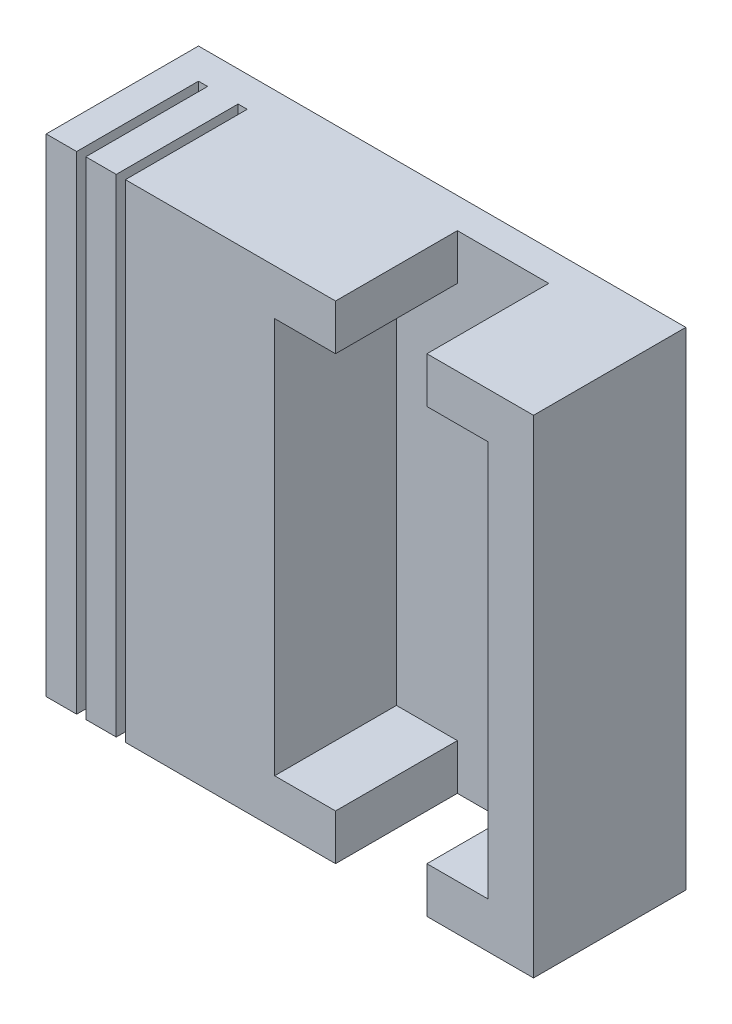
ISO-10303-21;
HEADER;
FILE_DESCRIPTION(('STEP AP214'),'2;1');
FILE_NAME('part.step','',(''),(''),'','','');
FILE_SCHEMA(('AUTOMOTIVE_DESIGN { 1 0 10303 214 1 1 1 1 }'));
ENDSEC;
DATA;
#1=APPLICATION_CONTEXT('core data for automotive mechanical design processes');
#2=APPLICATION_PROTOCOL_DEFINITION('international standard','automotive_design',2000,#1);
#3=PRODUCT_CONTEXT('',#1,'mechanical');
#4=PRODUCT('Part','Part','',(#3));
#5=PRODUCT_RELATED_PRODUCT_CATEGORY('part','',(#4));
#6=PRODUCT_DEFINITION_FORMATION('','',#4);
#7=PRODUCT_DEFINITION_CONTEXT('part definition',#1,'design');
#8=PRODUCT_DEFINITION('design','',#6,#7);
#9=PRODUCT_DEFINITION_SHAPE('','',#8);
#10=(LENGTH_UNIT() NAMED_UNIT(*) SI_UNIT(.MILLI.,.METRE.));
#11=(NAMED_UNIT(*) PLANE_ANGLE_UNIT() SI_UNIT($,.RADIAN.));
#12=(NAMED_UNIT(*) SI_UNIT($,.STERADIAN.) SOLID_ANGLE_UNIT());
#13=UNCERTAINTY_MEASURE_WITH_UNIT(LENGTH_MEASURE(1.E-05),#10,'distance_accuracy_value','');
#14=(GEOMETRIC_REPRESENTATION_CONTEXT(3) GLOBAL_UNCERTAINTY_ASSIGNED_CONTEXT((#13)) GLOBAL_UNIT_ASSIGNED_CONTEXT((#10,
#11,#12)) REPRESENTATION_CONTEXT('',''));
#15=CARTESIAN_POINT('',(0.,0.,0.));
#16=DIRECTION('',(0.,0.,1.));
#17=DIRECTION('',(1.,0.,0.));
#18=AXIS2_PLACEMENT_3D('',#15,#16,#17);
#19=CARTESIAN_POINT('',(0.,0.,6.35));
#20=DIRECTION('',(0.,0.,-1.));
#21=DIRECTION('',(-1.,0.,0.));
#22=AXIS2_PLACEMENT_3D('',#19,#20,#21);
#23=PLANE('',#22);
#24=DIRECTION('',(1.,0.,0.));
#25=VECTOR('',#24,1.);
#26=CARTESIAN_POINT('',(0.,0.,6.35));
#27=LINE('',#26,#25);
#28=CARTESIAN_POINT('',(-20.32,0.,6.35));
#29=VERTEX_POINT('',#28);
#30=CARTESIAN_POINT('',(-19.05,0.,6.35));
#31=VERTEX_POINT('',#30);
#32=EDGE_CURVE('E453',#29,#31,#27,.T.);
#33=ORIENTED_EDGE('',*,*,#32,.T.);
#34=DIRECTION('',(0.,1.,0.));
#35=VECTOR('',#34,1.);
#36=CARTESIAN_POINT('',(-19.05,0.,6.35));
#37=LINE('',#36,#35);
#38=CARTESIAN_POINT('',(-19.05,20.32,6.35));
#39=VERTEX_POINT('',#38);
#40=EDGE_CURVE('E289',#31,#39,#37,.T.);
#41=ORIENTED_EDGE('',*,*,#40,.T.);
#42=DIRECTION('',(-1.,0.,0.));
#43=VECTOR('',#42,1.);
#44=CARTESIAN_POINT('',(0.,20.32,6.35));
#45=LINE('',#44,#43);
#46=CARTESIAN_POINT('',(-20.32,20.32,6.35));
#47=VERTEX_POINT('',#46);
#48=EDGE_CURVE('E241',#39,#47,#45,.T.);
#49=ORIENTED_EDGE('',*,*,#48,.T.);
#50=DIRECTION('',(0.,-1.,0.));
#51=VECTOR('',#50,1.);
#52=CARTESIAN_POINT('',(-20.32,0.,6.35));
#53=LINE('',#52,#51);
#54=EDGE_CURVE('E240',#47,#29,#53,.T.);
#55=ORIENTED_EDGE('',*,*,#54,.T.);
#56=EDGE_LOOP('',(#33,#41,#49,#55));
#57=FACE_BOUND('',#56,.T.);
#58=ADVANCED_FACE('F45',(#57),#23,.F.);
#59=CARTESIAN_POINT('',(-17.399,20.32,6.35));
#60=VERTEX_POINT('',#59);
#61=CARTESIAN_POINT('',(-18.669,20.32,6.35));
#62=VERTEX_POINT('',#61);
#63=EDGE_CURVE('E235',#60,#62,#45,.T.);
#64=ORIENTED_EDGE('',*,*,#63,.T.);
#65=DIRECTION('',(0.,-1.,0.));
#66=VECTOR('',#65,1.);
#67=CARTESIAN_POINT('',(-18.669,0.,6.35));
#68=LINE('',#67,#66);
#69=CARTESIAN_POINT('',(-18.669,0.,6.35));
#70=VERTEX_POINT('',#69);
#71=EDGE_CURVE('E286',#62,#70,#68,.T.);
#72=ORIENTED_EDGE('',*,*,#71,.T.);
#73=CARTESIAN_POINT('',(-17.399,0.,6.35));
#74=VERTEX_POINT('',#73);
#75=EDGE_CURVE('E456',#70,#74,#27,.T.);
#76=ORIENTED_EDGE('',*,*,#75,.T.);
#77=DIRECTION('',(0.,1.,0.));
#78=VECTOR('',#77,1.);
#79=CARTESIAN_POINT('',(-17.399,0.,6.35));
#80=LINE('',#79,#78);
#81=EDGE_CURVE('E214',#74,#60,#80,.T.);
#82=ORIENTED_EDGE('',*,*,#81,.T.);
#83=EDGE_LOOP('',(#64,#72,#76,#82));
#84=FACE_BOUND('',#83,.T.);
#85=ADVANCED_FACE('F529',(#84),#23,.F.);
#86=CARTESIAN_POINT('',(0.,20.32,6.35));
#87=VERTEX_POINT('',#86);
#88=CARTESIAN_POINT('',(-4.445,20.32,6.35));
#89=VERTEX_POINT('',#88);
#90=EDGE_CURVE('E234',#87,#89,#45,.T.);
#91=ORIENTED_EDGE('',*,*,#90,.T.);
#92=DIRECTION('',(0.,1.,0.));
#93=VECTOR('',#92,1.);
#94=CARTESIAN_POINT('',(-4.445,18.415,6.35));
#95=LINE('',#94,#93);
#96=CARTESIAN_POINT('',(-4.445,18.415,6.35));
#97=VERTEX_POINT('',#96);
#98=EDGE_CURVE('E404',#97,#89,#95,.T.);
#99=ORIENTED_EDGE('',*,*,#98,.F.);
#100=DIRECTION('',(-1.,0.,0.));
#101=VECTOR('',#100,1.);
#102=CARTESIAN_POINT('',(-4.445,18.415,6.35));
#103=LINE('',#102,#101);
#104=CARTESIAN_POINT('',(-1.905,18.415,6.35));
#105=VERTEX_POINT('',#104);
#106=EDGE_CURVE('E400',#105,#97,#103,.T.);
#107=ORIENTED_EDGE('',*,*,#106,.F.);
#108=DIRECTION('',(0.,1.,0.));
#109=VECTOR('',#108,1.);
#110=CARTESIAN_POINT('',(-1.905,18.415,6.35));
#111=LINE('',#110,#109);
#112=CARTESIAN_POINT('',(-1.905,1.905,6.35));
#113=VERTEX_POINT('',#112);
#114=EDGE_CURVE('E396',#113,#105,#111,.T.);
#115=ORIENTED_EDGE('',*,*,#114,.F.);
#116=DIRECTION('',(1.,0.,0.));
#117=VECTOR('',#116,1.);
#118=CARTESIAN_POINT('',(-4.445,1.905,6.35));
#119=LINE('',#118,#117);
#120=CARTESIAN_POINT('',(-4.445,1.905,6.35));
#121=VERTEX_POINT('',#120);
#122=EDGE_CURVE('E392',#121,#113,#119,.T.);
#123=ORIENTED_EDGE('',*,*,#122,.F.);
#124=DIRECTION('',(0.,-1.,0.));
#125=VECTOR('',#124,1.);
#126=CARTESIAN_POINT('',(-4.445,0.,6.35));
#127=LINE('',#126,#125);
#128=CARTESIAN_POINT('',(-4.445,0.,6.35));
#129=VERTEX_POINT('',#128);
#130=EDGE_CURVE('E215',#121,#129,#127,.T.);
#131=ORIENTED_EDGE('',*,*,#130,.T.);
#132=CARTESIAN_POINT('',(0.,0.,6.35));
#133=VERTEX_POINT('',#132);
#134=EDGE_CURVE('E264',#129,#133,#27,.T.);
#135=ORIENTED_EDGE('',*,*,#134,.T.);
#136=DIRECTION('',(0.,1.,0.));
#137=VECTOR('',#136,1.);
#138=CARTESIAN_POINT('',(0.,0.,6.35));
#139=LINE('',#138,#137);
#140=EDGE_CURVE('E245',#133,#87,#139,.T.);
#141=ORIENTED_EDGE('',*,*,#140,.T.);
#142=EDGE_LOOP('',(#91,#99,#107,#115,#123,#131,#135,#141));
#143=FACE_BOUND('',#142,.T.);
#144=ADVANCED_FACE('F468',(#143),#23,.F.);
#145=CARTESIAN_POINT('',(0.,0.,6.35));
#146=DIRECTION('',(0.,1.,0.));
#147=DIRECTION('',(0.,0.,1.));
#148=AXIS2_PLACEMENT_3D('',#145,#146,#147);
#149=PLANE('',#148);
#150=DIRECTION('',(1.,0.,0.));
#151=VECTOR('',#150,1.);
#152=CARTESIAN_POINT('',(0.,0.,1.27));
#153=LINE('',#152,#151);
#154=CARTESIAN_POINT('',(-19.05,0.,1.27));
#155=VERTEX_POINT('',#154);
#156=CARTESIAN_POINT('',(-18.669,0.,1.27));
#157=VERTEX_POINT('',#156);
#158=EDGE_CURVE('E333',#155,#157,#153,.T.);
#159=ORIENTED_EDGE('',*,*,#158,.F.);
#160=DIRECTION('',(0.,0.,1.));
#161=VECTOR('',#160,1.);
#162=CARTESIAN_POINT('',(-19.05,0.,6.35));
#163=LINE('',#162,#161);
#164=EDGE_CURVE('E326',#155,#31,#163,.T.);
#165=ORIENTED_EDGE('',*,*,#164,.T.);
#166=ORIENTED_EDGE('',*,*,#32,.F.);
#167=DIRECTION('',(0.,0.,-1.));
#168=VECTOR('',#167,1.);
#169=CARTESIAN_POINT('',(-20.32,0.,6.35));
#170=LINE('',#169,#168);
#171=CARTESIAN_POINT('',(-20.32,0.,0.));
#172=VERTEX_POINT('',#171);
#173=EDGE_CURVE('E249',#29,#172,#170,.T.);
#174=ORIENTED_EDGE('',*,*,#173,.T.);
#175=DIRECTION('',(1.,0.,0.));
#176=VECTOR('',#175,1.);
#177=CARTESIAN_POINT('',(0.,0.,0.));
#178=LINE('',#177,#176);
#179=CARTESIAN_POINT('',(0.,0.,0.));
#180=VERTEX_POINT('',#179);
#181=EDGE_CURVE('E250',#172,#180,#178,.T.);
#182=ORIENTED_EDGE('',*,*,#181,.T.);
#183=DIRECTION('',(0.,0.,-1.));
#184=VECTOR('',#183,1.);
#185=CARTESIAN_POINT('',(0.,0.,6.35));
#186=LINE('',#185,#184);
#187=EDGE_CURVE('E276',#133,#180,#186,.T.);
#188=ORIENTED_EDGE('',*,*,#187,.F.);
#189=ORIENTED_EDGE('',*,*,#134,.F.);
#190=DIRECTION('',(0.,0.,-1.));
#191=VECTOR('',#190,1.);
#192=CARTESIAN_POINT('',(-4.445,0.,6.35));
#193=LINE('',#192,#191);
#194=CARTESIAN_POINT('',(-4.445,0.,1.27));
#195=VERTEX_POINT('',#194);
#196=EDGE_CURVE('E448',#129,#195,#193,.T.);
#197=ORIENTED_EDGE('',*,*,#196,.T.);
#198=DIRECTION('',(1.,0.,0.));
#199=VECTOR('',#198,1.);
#200=CARTESIAN_POINT('',(0.,0.,1.27));
#201=LINE('',#200,#199);
#202=CARTESIAN_POINT('',(-8.255,0.,1.27));
#203=VERTEX_POINT('',#202);
#204=EDGE_CURVE('E255',#203,#195,#201,.T.);
#205=ORIENTED_EDGE('',*,*,#204,.F.);
#206=DIRECTION('',(0.,0.,1.));
#207=VECTOR('',#206,1.);
#208=CARTESIAN_POINT('',(-8.255,0.,6.35));
#209=LINE('',#208,#207);
#210=CARTESIAN_POINT('',(-8.255,0.,6.35));
#211=VERTEX_POINT('',#210);
#212=EDGE_CURVE('E415',#203,#211,#209,.T.);
#213=ORIENTED_EDGE('',*,*,#212,.T.);
#214=CARTESIAN_POINT('',(-17.018,0.,6.35));
#215=VERTEX_POINT('',#214);
#216=EDGE_CURVE('E457',#215,#211,#27,.T.);
#217=ORIENTED_EDGE('',*,*,#216,.F.);
#218=DIRECTION('',(0.,0.,-1.));
#219=VECTOR('',#218,1.);
#220=CARTESIAN_POINT('',(-17.018,0.,6.35));
#221=LINE('',#220,#219);
#222=CARTESIAN_POINT('',(-17.018,0.,1.27));
#223=VERTEX_POINT('',#222);
#224=EDGE_CURVE('E61',#215,#223,#221,.T.);
#225=ORIENTED_EDGE('',*,*,#224,.T.);
#226=DIRECTION('',(1.,0.,0.));
#227=VECTOR('',#226,1.);
#228=CARTESIAN_POINT('',(0.,0.,1.27));
#229=LINE('',#228,#227);
#230=CARTESIAN_POINT('',(-17.399,0.,1.27));
#231=VERTEX_POINT('',#230);
#232=EDGE_CURVE('E330',#231,#223,#229,.T.);
#233=ORIENTED_EDGE('',*,*,#232,.F.);
#234=DIRECTION('',(0.,0.,1.));
#235=VECTOR('',#234,1.);
#236=CARTESIAN_POINT('',(-17.399,0.,6.35));
#237=LINE('',#236,#235);
#238=EDGE_CURVE('E304',#231,#74,#237,.T.);
#239=ORIENTED_EDGE('',*,*,#238,.T.);
#240=ORIENTED_EDGE('',*,*,#75,.F.);
#241=DIRECTION('',(0.,0.,-1.));
#242=VECTOR('',#241,1.);
#243=CARTESIAN_POINT('',(-18.669,0.,6.35));
#244=LINE('',#243,#242);
#245=EDGE_CURVE('E69',#70,#157,#244,.T.);
#246=ORIENTED_EDGE('',*,*,#245,.T.);
#247=EDGE_LOOP('',(#159,#165,#166,#174,#182,#188,#189,#197,#205,#213,#217,#225,#233,#239,#240,#246));
#248=FACE_BOUND('',#247,.T.);
#249=ADVANCED_FACE('F47',(#248),#149,.F.);
#250=CARTESIAN_POINT('',(0.,0.,6.35));
#251=DIRECTION('',(-1.,0.,0.));
#252=DIRECTION('',(0.,0.,1.));
#253=AXIS2_PLACEMENT_3D('',#250,#251,#252);
#254=PLANE('',#253);
#255=DIRECTION('',(0.,1.,0.));
#256=VECTOR('',#255,1.);
#257=CARTESIAN_POINT('',(0.,0.,0.));
#258=LINE('',#257,#256);
#259=CARTESIAN_POINT('',(0.,20.32,0.));
#260=VERTEX_POINT('',#259);
#261=EDGE_CURVE('E254',#180,#260,#258,.T.);
#262=ORIENTED_EDGE('',*,*,#261,.T.);
#263=DIRECTION('',(0.,0.,-1.));
#264=VECTOR('',#263,1.);
#265=CARTESIAN_POINT('',(0.,20.32,6.35));
#266=LINE('',#265,#264);
#267=EDGE_CURVE('E272',#87,#260,#266,.T.);
#268=ORIENTED_EDGE('',*,*,#267,.F.);
#269=ORIENTED_EDGE('',*,*,#140,.F.);
#270=ORIENTED_EDGE('',*,*,#187,.T.);
#271=EDGE_LOOP('',(#262,#268,#269,#270));
#272=FACE_BOUND('',#271,.T.);
#273=ADVANCED_FACE('F474',(#272),#254,.F.);
#274=CARTESIAN_POINT('',(0.,20.32,6.35));
#275=DIRECTION('',(0.,-1.,0.));
#276=DIRECTION('',(0.,0.,-1.));
#277=AXIS2_PLACEMENT_3D('',#274,#275,#276);
#278=PLANE('',#277);
#279=ORIENTED_EDGE('',*,*,#48,.F.);
#280=DIRECTION('',(0.,0.,-1.));
#281=VECTOR('',#280,1.);
#282=CARTESIAN_POINT('',(-19.05,20.32,6.35));
#283=LINE('',#282,#281);
#284=CARTESIAN_POINT('',(-19.05,20.32,1.27));
#285=VERTEX_POINT('',#284);
#286=EDGE_CURVE('E322',#39,#285,#283,.T.);
#287=ORIENTED_EDGE('',*,*,#286,.T.);
#288=DIRECTION('',(-1.,0.,0.));
#289=VECTOR('',#288,1.);
#290=CARTESIAN_POINT('',(0.,20.32,1.27));
#291=LINE('',#290,#289);
#292=CARTESIAN_POINT('',(-18.669,20.32,1.27));
#293=VERTEX_POINT('',#292);
#294=EDGE_CURVE('E11',#293,#285,#291,.T.);
#295=ORIENTED_EDGE('',*,*,#294,.F.);
#296=DIRECTION('',(0.,0.,1.));
#297=VECTOR('',#296,1.);
#298=CARTESIAN_POINT('',(-18.669,20.32,6.35));
#299=LINE('',#298,#297);
#300=EDGE_CURVE('E314',#293,#62,#299,.T.);
#301=ORIENTED_EDGE('',*,*,#300,.T.);
#302=ORIENTED_EDGE('',*,*,#63,.F.);
#303=DIRECTION('',(0.,0.,-1.));
#304=VECTOR('',#303,1.);
#305=CARTESIAN_POINT('',(-17.399,20.32,6.35));
#306=LINE('',#305,#304);
#307=CARTESIAN_POINT('',(-17.399,20.32,1.27));
#308=VERTEX_POINT('',#307);
#309=EDGE_CURVE('E302',#60,#308,#306,.T.);
#310=ORIENTED_EDGE('',*,*,#309,.T.);
#311=DIRECTION('',(-1.,0.,0.));
#312=VECTOR('',#311,1.);
#313=CARTESIAN_POINT('',(0.,20.32,1.27));
#314=LINE('',#313,#312);
#315=CARTESIAN_POINT('',(-17.018,20.32,1.27));
#316=VERTEX_POINT('',#315);
#317=EDGE_CURVE('E54',#316,#308,#314,.T.);
#318=ORIENTED_EDGE('',*,*,#317,.F.);
#319=DIRECTION('',(0.,0.,1.));
#320=VECTOR('',#319,1.);
#321=CARTESIAN_POINT('',(-17.018,20.32,6.35));
#322=LINE('',#321,#320);
#323=CARTESIAN_POINT('',(-17.018,20.32,6.35));
#324=VERTEX_POINT('',#323);
#325=EDGE_CURVE('E208',#316,#324,#322,.T.);
#326=ORIENTED_EDGE('',*,*,#325,.T.);
#327=CARTESIAN_POINT('',(-8.255,20.32,6.35));
#328=VERTEX_POINT('',#327);
#329=EDGE_CURVE('E223',#328,#324,#45,.T.);
#330=ORIENTED_EDGE('',*,*,#329,.F.);
#331=DIRECTION('',(0.,0.,1.));
#332=VECTOR('',#331,1.);
#333=CARTESIAN_POINT('',(-8.255,20.32,1.27));
#334=LINE('',#333,#332);
#335=CARTESIAN_POINT('',(-8.255,20.32,1.27));
#336=VERTEX_POINT('',#335);
#337=EDGE_CURVE('E419',#336,#328,#334,.T.);
#338=ORIENTED_EDGE('',*,*,#337,.F.);
#339=DIRECTION('',(-1.,0.,0.));
#340=VECTOR('',#339,1.);
#341=CARTESIAN_POINT('',(-8.255,20.32,1.27));
#342=LINE('',#341,#340);
#343=CARTESIAN_POINT('',(-4.445,20.32,1.27));
#344=VERTEX_POINT('',#343);
#345=EDGE_CURVE('E369',#344,#336,#342,.T.);
#346=ORIENTED_EDGE('',*,*,#345,.F.);
#347=DIRECTION('',(0.,0.,1.));
#348=VECTOR('',#347,1.);
#349=CARTESIAN_POINT('',(-4.445,20.32,1.27));
#350=LINE('',#349,#348);
#351=EDGE_CURVE('E422',#344,#89,#350,.T.);
#352=ORIENTED_EDGE('',*,*,#351,.T.);
#353=ORIENTED_EDGE('',*,*,#90,.F.);
#354=ORIENTED_EDGE('',*,*,#267,.T.);
#355=DIRECTION('',(-1.,0.,0.));
#356=VECTOR('',#355,1.);
#357=CARTESIAN_POINT('',(0.,20.32,0.));
#358=LINE('',#357,#356);
#359=CARTESIAN_POINT('',(-20.32,20.32,0.));
#360=VERTEX_POINT('',#359);
#361=EDGE_CURVE('E258',#260,#360,#358,.T.);
#362=ORIENTED_EDGE('',*,*,#361,.T.);
#363=DIRECTION('',(0.,0.,-1.));
#364=VECTOR('',#363,1.);
#365=CARTESIAN_POINT('',(-20.32,20.32,6.35));
#366=LINE('',#365,#364);
#367=EDGE_CURVE('E268',#47,#360,#366,.T.);
#368=ORIENTED_EDGE('',*,*,#367,.F.);
#369=EDGE_LOOP('',(#279,#287,#295,#301,#302,#310,#318,#326,#330,#338,#346,#352,#353,#354,#362,#368));
#370=FACE_BOUND('',#369,.T.);
#371=ADVANCED_FACE('F221',(#370),#278,.F.);
#372=CARTESIAN_POINT('',(-20.32,0.,6.35));
#373=DIRECTION('',(1.,0.,0.));
#374=DIRECTION('',(0.,0.,-1.));
#375=AXIS2_PLACEMENT_3D('',#372,#373,#374);
#376=PLANE('',#375);
#377=DIRECTION('',(0.,-1.,0.));
#378=VECTOR('',#377,1.);
#379=CARTESIAN_POINT('',(-20.32,0.,0.));
#380=LINE('',#379,#378);
#381=EDGE_CURVE('E261',#360,#172,#380,.T.);
#382=ORIENTED_EDGE('',*,*,#381,.T.);
#383=ORIENTED_EDGE('',*,*,#173,.F.);
#384=ORIENTED_EDGE('',*,*,#54,.F.);
#385=ORIENTED_EDGE('',*,*,#367,.T.);
#386=EDGE_LOOP('',(#382,#383,#384,#385));
#387=FACE_BOUND('',#386,.T.);
#388=ADVANCED_FACE('F535',(#387),#376,.F.);
#389=ORIENTED_EDGE('',*,*,#329,.T.);
#390=DIRECTION('',(0.,-1.,0.));
#391=VECTOR('',#390,1.);
#392=CARTESIAN_POINT('',(-17.018,0.,6.35));
#393=LINE('',#392,#391);
#394=EDGE_CURVE('E205',#324,#215,#393,.T.);
#395=ORIENTED_EDGE('',*,*,#394,.T.);
#396=ORIENTED_EDGE('',*,*,#216,.T.);
#397=DIRECTION('',(0.,-1.,0.));
#398=VECTOR('',#397,1.);
#399=CARTESIAN_POINT('',(-8.255,1.905,6.35));
#400=LINE('',#399,#398);
#401=CARTESIAN_POINT('',(-8.255,1.905,6.35));
#402=VERTEX_POINT('',#401);
#403=EDGE_CURVE('E388',#402,#211,#400,.T.);
#404=ORIENTED_EDGE('',*,*,#403,.F.);
#405=DIRECTION('',(1.,0.,0.));
#406=VECTOR('',#405,1.);
#407=CARTESIAN_POINT('',(-10.795,1.905,6.35));
#408=LINE('',#407,#406);
#409=CARTESIAN_POINT('',(-10.795,1.905,6.35));
#410=VERTEX_POINT('',#409);
#411=EDGE_CURVE('E384',#410,#402,#408,.T.);
#412=ORIENTED_EDGE('',*,*,#411,.F.);
#413=DIRECTION('',(0.,-1.,0.));
#414=VECTOR('',#413,1.);
#415=CARTESIAN_POINT('',(-10.795,18.415,6.35));
#416=LINE('',#415,#414);
#417=CARTESIAN_POINT('',(-10.795,18.415,6.35));
#418=VERTEX_POINT('',#417);
#419=EDGE_CURVE('E336',#418,#410,#416,.T.);
#420=ORIENTED_EDGE('',*,*,#419,.F.);
#421=DIRECTION('',(-1.,0.,0.));
#422=VECTOR('',#421,1.);
#423=CARTESIAN_POINT('',(-10.795,18.415,6.35));
#424=LINE('',#423,#422);
#425=CARTESIAN_POINT('',(-8.255,18.415,6.35));
#426=VERTEX_POINT('',#425);
#427=EDGE_CURVE('E342',#426,#418,#424,.T.);
#428=ORIENTED_EDGE('',*,*,#427,.F.);
#429=DIRECTION('',(0.,-1.,0.));
#430=VECTOR('',#429,1.);
#431=CARTESIAN_POINT('',(-8.255,18.415,6.35));
#432=LINE('',#431,#430);
#433=EDGE_CURVE('E232',#328,#426,#432,.T.);
#434=ORIENTED_EDGE('',*,*,#433,.F.);
#435=EDGE_LOOP('',(#389,#395,#396,#404,#412,#420,#428,#434));
#436=FACE_BOUND('',#435,.T.);
#437=ADVANCED_FACE('F229',(#436),#23,.F.);
#438=CARTESIAN_POINT('',(0.,0.,0.));
#439=DIRECTION('',(0.,0.,-1.));
#440=DIRECTION('',(-1.,0.,0.));
#441=AXIS2_PLACEMENT_3D('',#438,#439,#440);
#442=PLANE('',#441);
#443=ORIENTED_EDGE('',*,*,#181,.F.);
#444=ORIENTED_EDGE('',*,*,#381,.F.);
#445=ORIENTED_EDGE('',*,*,#361,.F.);
#446=ORIENTED_EDGE('',*,*,#261,.F.);
#447=EDGE_LOOP('',(#443,#444,#445,#446));
#448=FACE_BOUND('',#447,.T.);
#449=ADVANCED_FACE('F481',(#448),#442,.T.);
#450=CARTESIAN_POINT('',(0.,0.,1.27));
#451=DIRECTION('',(0.,0.,1.));
#452=DIRECTION('',(1.,0.,0.));
#453=AXIS2_PLACEMENT_3D('',#450,#451,#452);
#454=PLANE('',#453);
#455=ORIENTED_EDGE('',*,*,#204,.T.);
#456=DIRECTION('',(0.,1.,0.));
#457=VECTOR('',#456,1.);
#458=CARTESIAN_POINT('',(-4.445,1.905,1.27));
#459=LINE('',#458,#457);
#460=CARTESIAN_POINT('',(-4.445,1.905,1.27));
#461=VERTEX_POINT('',#460);
#462=EDGE_CURVE('E350',#195,#461,#459,.T.);
#463=ORIENTED_EDGE('',*,*,#462,.T.);
#464=DIRECTION('',(1.,0.,0.));
#465=VECTOR('',#464,1.);
#466=CARTESIAN_POINT('',(-4.445,1.905,1.27));
#467=LINE('',#466,#465);
#468=CARTESIAN_POINT('',(-1.905,1.905,1.27));
#469=VERTEX_POINT('',#468);
#470=EDGE_CURVE('E353',#461,#469,#467,.T.);
#471=ORIENTED_EDGE('',*,*,#470,.T.);
#472=DIRECTION('',(0.,1.,0.));
#473=VECTOR('',#472,1.);
#474=CARTESIAN_POINT('',(-1.905,18.415,1.27));
#475=LINE('',#474,#473);
#476=CARTESIAN_POINT('',(-1.905,18.415,1.27));
#477=VERTEX_POINT('',#476);
#478=EDGE_CURVE('E357',#469,#477,#475,.T.);
#479=ORIENTED_EDGE('',*,*,#478,.T.);
#480=DIRECTION('',(-1.,0.,0.));
#481=VECTOR('',#480,1.);
#482=CARTESIAN_POINT('',(-4.445,18.415,1.27));
#483=LINE('',#482,#481);
#484=CARTESIAN_POINT('',(-4.445,18.415,1.27));
#485=VERTEX_POINT('',#484);
#486=EDGE_CURVE('E361',#477,#485,#483,.T.);
#487=ORIENTED_EDGE('',*,*,#486,.T.);
#488=DIRECTION('',(0.,1.,0.));
#489=VECTOR('',#488,1.);
#490=CARTESIAN_POINT('',(-4.445,18.415,1.27));
#491=LINE('',#490,#489);
#492=EDGE_CURVE('E365',#485,#344,#491,.T.);
#493=ORIENTED_EDGE('',*,*,#492,.T.);
#494=ORIENTED_EDGE('',*,*,#345,.T.);
#495=DIRECTION('',(0.,-1.,0.));
#496=VECTOR('',#495,1.);
#497=CARTESIAN_POINT('',(-8.255,18.415,1.27));
#498=LINE('',#497,#496);
#499=CARTESIAN_POINT('',(-8.255,18.415,1.27));
#500=VERTEX_POINT('',#499);
#501=EDGE_CURVE('E373',#336,#500,#498,.T.);
#502=ORIENTED_EDGE('',*,*,#501,.T.);
#503=DIRECTION('',(-1.,0.,0.));
#504=VECTOR('',#503,1.);
#505=CARTESIAN_POINT('',(-10.795,18.415,1.27));
#506=LINE('',#505,#504);
#507=CARTESIAN_POINT('',(-10.795,18.415,1.27));
#508=VERTEX_POINT('',#507);
#509=EDGE_CURVE('E377',#500,#508,#506,.T.);
#510=ORIENTED_EDGE('',*,*,#509,.T.);
#511=DIRECTION('',(0.,-1.,0.));
#512=VECTOR('',#511,1.);
#513=CARTESIAN_POINT('',(-10.795,18.415,1.27));
#514=LINE('',#513,#512);
#515=CARTESIAN_POINT('',(-10.795,1.905,1.27));
#516=VERTEX_POINT('',#515);
#517=EDGE_CURVE('E337',#508,#516,#514,.T.);
#518=ORIENTED_EDGE('',*,*,#517,.T.);
#519=DIRECTION('',(1.,0.,0.));
#520=VECTOR('',#519,1.);
#521=CARTESIAN_POINT('',(-10.795,1.905,1.27));
#522=LINE('',#521,#520);
#523=CARTESIAN_POINT('',(-8.255,1.905,1.27));
#524=VERTEX_POINT('',#523);
#525=EDGE_CURVE('E341',#516,#524,#522,.T.);
#526=ORIENTED_EDGE('',*,*,#525,.T.);
#527=DIRECTION('',(0.,-1.,0.));
#528=VECTOR('',#527,1.);
#529=CARTESIAN_POINT('',(-8.255,1.905,1.27));
#530=LINE('',#529,#528);
#531=EDGE_CURVE('E346',#524,#203,#530,.T.);
#532=ORIENTED_EDGE('',*,*,#531,.T.);
#533=EDGE_LOOP('',(#455,#463,#471,#479,#487,#493,#494,#502,#510,#518,#526,#532));
#534=FACE_BOUND('',#533,.T.);
#535=ADVANCED_FACE('F506',(#534),#454,.T.);
#536=CARTESIAN_POINT('',(-4.445,1.905,1.27));
#537=DIRECTION('',(1.,0.,0.));
#538=DIRECTION('',(0.,0.,-1.));
#539=AXIS2_PLACEMENT_3D('',#536,#537,#538);
#540=PLANE('',#539);
#541=ORIENTED_EDGE('',*,*,#130,.F.);
#542=DIRECTION('',(0.,0.,1.));
#543=VECTOR('',#542,1.);
#544=CARTESIAN_POINT('',(-4.445,1.905,1.27));
#545=LINE('',#544,#543);
#546=EDGE_CURVE('E435',#461,#121,#545,.T.);
#547=ORIENTED_EDGE('',*,*,#546,.F.);
#548=ORIENTED_EDGE('',*,*,#462,.F.);
#549=ORIENTED_EDGE('',*,*,#196,.F.);
#550=EDGE_LOOP('',(#541,#547,#548,#549));
#551=FACE_BOUND('',#550,.T.);
#552=ADVANCED_FACE('F503',(#551),#540,.F.);
#553=CARTESIAN_POINT('',(-8.255,1.905,1.27));
#554=DIRECTION('',(-1.,0.,0.));
#555=DIRECTION('',(0.,0.,1.));
#556=AXIS2_PLACEMENT_3D('',#553,#554,#555);
#557=PLANE('',#556);
#558=ORIENTED_EDGE('',*,*,#531,.F.);
#559=DIRECTION('',(0.,0.,1.));
#560=VECTOR('',#559,1.);
#561=CARTESIAN_POINT('',(-8.255,1.905,1.27));
#562=LINE('',#561,#560);
#563=EDGE_CURVE('E439',#524,#402,#562,.T.);
#564=ORIENTED_EDGE('',*,*,#563,.T.);
#565=ORIENTED_EDGE('',*,*,#403,.T.);
#566=ORIENTED_EDGE('',*,*,#212,.F.);
#567=EDGE_LOOP('',(#558,#564,#565,#566));
#568=FACE_BOUND('',#567,.T.);
#569=ADVANCED_FACE('F510',(#568),#557,.F.);
#570=CARTESIAN_POINT('',(-10.795,18.415,1.27));
#571=DIRECTION('',(-1.,0.,0.));
#572=DIRECTION('',(0.,-1.,0.));
#573=AXIS2_PLACEMENT_3D('',#570,#571,#572);
#574=PLANE('',#573);
#575=ORIENTED_EDGE('',*,*,#419,.T.);
#576=DIRECTION('',(0.,0.,1.));
#577=VECTOR('',#576,1.);
#578=CARTESIAN_POINT('',(-10.795,1.905,1.27));
#579=LINE('',#578,#577);
#580=EDGE_CURVE('E381',#516,#410,#579,.T.);
#581=ORIENTED_EDGE('',*,*,#580,.F.);
#582=ORIENTED_EDGE('',*,*,#517,.F.);
#583=DIRECTION('',(0.,0.,1.));
#584=VECTOR('',#583,1.);
#585=CARTESIAN_POINT('',(-10.795,18.415,1.27));
#586=LINE('',#585,#584);
#587=EDGE_CURVE('E412',#508,#418,#586,.T.);
#588=ORIENTED_EDGE('',*,*,#587,.T.);
#589=EDGE_LOOP('',(#575,#581,#582,#588));
#590=FACE_BOUND('',#589,.T.);
#591=ADVANCED_FACE('F553',(#590),#574,.F.);
#592=CARTESIAN_POINT('',(-10.795,18.415,1.27));
#593=DIRECTION('',(0.,1.,0.));
#594=DIRECTION('',(0.,0.,1.));
#595=AXIS2_PLACEMENT_3D('',#592,#593,#594);
#596=PLANE('',#595);
#597=ORIENTED_EDGE('',*,*,#427,.T.);
#598=ORIENTED_EDGE('',*,*,#587,.F.);
#599=ORIENTED_EDGE('',*,*,#509,.F.);
#600=DIRECTION('',(0.,0.,1.));
#601=VECTOR('',#600,1.);
#602=CARTESIAN_POINT('',(-8.255,18.415,1.27));
#603=LINE('',#602,#601);
#604=EDGE_CURVE('E416',#500,#426,#603,.T.);
#605=ORIENTED_EDGE('',*,*,#604,.T.);
#606=EDGE_LOOP('',(#597,#598,#599,#605));
#607=FACE_BOUND('',#606,.T.);
#608=ADVANCED_FACE('F567',(#607),#596,.F.);
#609=CARTESIAN_POINT('',(-8.255,18.415,1.27));
#610=DIRECTION('',(-1.,0.,0.));
#611=DIRECTION('',(0.,0.,1.));
#612=AXIS2_PLACEMENT_3D('',#609,#610,#611);
#613=PLANE('',#612);
#614=ORIENTED_EDGE('',*,*,#433,.T.);
#615=ORIENTED_EDGE('',*,*,#604,.F.);
#616=ORIENTED_EDGE('',*,*,#501,.F.);
#617=ORIENTED_EDGE('',*,*,#337,.T.);
#618=EDGE_LOOP('',(#614,#615,#616,#617));
#619=FACE_BOUND('',#618,.T.);
#620=ADVANCED_FACE('F570',(#619),#613,.F.);
#621=CARTESIAN_POINT('',(-4.445,18.415,1.27));
#622=DIRECTION('',(1.,0.,0.));
#623=DIRECTION('',(0.,0.,-1.));
#624=AXIS2_PLACEMENT_3D('',#621,#622,#623);
#625=PLANE('',#624);
#626=ORIENTED_EDGE('',*,*,#98,.T.);
#627=ORIENTED_EDGE('',*,*,#351,.F.);
#628=ORIENTED_EDGE('',*,*,#492,.F.);
#629=DIRECTION('',(0.,0.,1.));
#630=VECTOR('',#629,1.);
#631=CARTESIAN_POINT('',(-4.445,18.415,1.27));
#632=LINE('',#631,#630);
#633=EDGE_CURVE('E426',#485,#97,#632,.T.);
#634=ORIENTED_EDGE('',*,*,#633,.T.);
#635=EDGE_LOOP('',(#626,#627,#628,#634));
#636=FACE_BOUND('',#635,.T.);
#637=ADVANCED_FACE('F489',(#636),#625,.F.);
#638=CARTESIAN_POINT('',(-4.445,18.415,1.27));
#639=DIRECTION('',(0.,1.,0.));
#640=DIRECTION('',(0.,0.,1.));
#641=AXIS2_PLACEMENT_3D('',#638,#639,#640);
#642=PLANE('',#641);
#643=ORIENTED_EDGE('',*,*,#106,.T.);
#644=ORIENTED_EDGE('',*,*,#633,.F.);
#645=ORIENTED_EDGE('',*,*,#486,.F.);
#646=DIRECTION('',(0.,0.,1.));
#647=VECTOR('',#646,1.);
#648=CARTESIAN_POINT('',(-1.905,18.415,1.27));
#649=LINE('',#648,#647);
#650=EDGE_CURVE('E429',#477,#105,#649,.T.);
#651=ORIENTED_EDGE('',*,*,#650,.T.);
#652=EDGE_LOOP('',(#643,#644,#645,#651));
#653=FACE_BOUND('',#652,.T.);
#654=ADVANCED_FACE('F493',(#653),#642,.F.);
#655=CARTESIAN_POINT('',(-1.905,18.415,1.27));
#656=DIRECTION('',(1.,0.,0.));
#657=DIRECTION('',(0.,1.,0.));
#658=AXIS2_PLACEMENT_3D('',#655,#656,#657);
#659=PLANE('',#658);
#660=ORIENTED_EDGE('',*,*,#114,.T.);
#661=ORIENTED_EDGE('',*,*,#650,.F.);
#662=ORIENTED_EDGE('',*,*,#478,.F.);
#663=DIRECTION('',(0.,0.,1.));
#664=VECTOR('',#663,1.);
#665=CARTESIAN_POINT('',(-1.905,1.905,1.27));
#666=LINE('',#665,#664);
#667=EDGE_CURVE('E432',#469,#113,#666,.T.);
#668=ORIENTED_EDGE('',*,*,#667,.T.);
#669=EDGE_LOOP('',(#660,#661,#662,#668));
#670=FACE_BOUND('',#669,.T.);
#671=ADVANCED_FACE('F496',(#670),#659,.F.);
#672=CARTESIAN_POINT('',(-4.445,1.905,1.27));
#673=DIRECTION('',(0.,-1.,0.));
#674=DIRECTION('',(0.,0.,-1.));
#675=AXIS2_PLACEMENT_3D('',#672,#673,#674);
#676=PLANE('',#675);
#677=ORIENTED_EDGE('',*,*,#122,.T.);
#678=ORIENTED_EDGE('',*,*,#667,.F.);
#679=ORIENTED_EDGE('',*,*,#470,.F.);
#680=ORIENTED_EDGE('',*,*,#546,.T.);
#681=EDGE_LOOP('',(#677,#678,#679,#680));
#682=FACE_BOUND('',#681,.T.);
#683=ADVANCED_FACE('F498',(#682),#676,.F.);
#684=CARTESIAN_POINT('',(-10.795,1.905,1.27));
#685=DIRECTION('',(0.,-1.,0.));
#686=DIRECTION('',(1.,0.,0.));
#687=AXIS2_PLACEMENT_3D('',#684,#685,#686);
#688=PLANE('',#687);
#689=ORIENTED_EDGE('',*,*,#411,.T.);
#690=ORIENTED_EDGE('',*,*,#563,.F.);
#691=ORIENTED_EDGE('',*,*,#525,.F.);
#692=ORIENTED_EDGE('',*,*,#580,.T.);
#693=EDGE_LOOP('',(#689,#690,#691,#692));
#694=FACE_BOUND('',#693,.T.);
#695=ADVANCED_FACE('F582',(#694),#688,.F.);
#696=CARTESIAN_POINT('',(0.,0.,1.27));
#697=DIRECTION('',(0.,0.,1.));
#698=DIRECTION('',(1.,0.,0.));
#699=AXIS2_PLACEMENT_3D('',#696,#697,#698);
#700=PLANE('',#699);
#701=ORIENTED_EDGE('',*,*,#232,.T.);
#702=DIRECTION('',(0.,1.,0.));
#703=VECTOR('',#702,1.);
#704=CARTESIAN_POINT('',(-17.018,20.7812348128856,1.27));
#705=LINE('',#704,#703);
#706=EDGE_CURVE('E299',#223,#316,#705,.T.);
#707=ORIENTED_EDGE('',*,*,#706,.T.);
#708=ORIENTED_EDGE('',*,*,#317,.T.);
#709=DIRECTION('',(0.,-1.,0.));
#710=VECTOR('',#709,1.);
#711=CARTESIAN_POINT('',(-17.399,20.7812348128856,1.27));
#712=LINE('',#711,#710);
#713=EDGE_CURVE('E297',#308,#231,#712,.T.);
#714=ORIENTED_EDGE('',*,*,#713,.T.);
#715=EDGE_LOOP('',(#701,#707,#708,#714));
#716=FACE_BOUND('',#715,.T.);
#717=ADVANCED_FACE('F296',(#716),#700,.T.);
#718=CARTESIAN_POINT('',(-17.399,20.7812348128856,1.27));
#719=DIRECTION('',(-1.,0.,0.));
#720=DIRECTION('',(0.,0.,1.));
#721=AXIS2_PLACEMENT_3D('',#718,#719,#720);
#722=PLANE('',#721);
#723=ORIENTED_EDGE('',*,*,#713,.F.);
#724=ORIENTED_EDGE('',*,*,#309,.F.);
#725=ORIENTED_EDGE('',*,*,#81,.F.);
#726=ORIENTED_EDGE('',*,*,#238,.F.);
#727=EDGE_LOOP('',(#723,#724,#725,#726));
#728=FACE_BOUND('',#727,.T.);
#729=ADVANCED_FACE('F301',(#728),#722,.F.);
#730=CARTESIAN_POINT('',(-17.018,20.7812348128856,1.27));
#731=DIRECTION('',(1.,0.,0.));
#732=DIRECTION('',(0.,1.,0.));
#733=AXIS2_PLACEMENT_3D('',#730,#731,#732);
#734=PLANE('',#733);
#735=ORIENTED_EDGE('',*,*,#394,.F.);
#736=ORIENTED_EDGE('',*,*,#325,.F.);
#737=ORIENTED_EDGE('',*,*,#706,.F.);
#738=ORIENTED_EDGE('',*,*,#224,.F.);
#739=EDGE_LOOP('',(#735,#736,#737,#738));
#740=FACE_BOUND('',#739,.T.);
#741=ADVANCED_FACE('F207',(#740),#734,.F.);
#742=CARTESIAN_POINT('',(0.,0.,1.27));
#743=DIRECTION('',(0.,0.,1.));
#744=DIRECTION('',(1.,0.,0.));
#745=AXIS2_PLACEMENT_3D('',#742,#743,#744);
#746=PLANE('',#745);
#747=ORIENTED_EDGE('',*,*,#158,.T.);
#748=DIRECTION('',(0.,1.,0.));
#749=VECTOR('',#748,1.);
#750=CARTESIAN_POINT('',(-18.669,20.7812348128856,1.27));
#751=LINE('',#750,#749);
#752=EDGE_CURVE('E226',#157,#293,#751,.T.);
#753=ORIENTED_EDGE('',*,*,#752,.T.);
#754=ORIENTED_EDGE('',*,*,#294,.T.);
#755=DIRECTION('',(0.,-1.,0.));
#756=VECTOR('',#755,1.);
#757=CARTESIAN_POINT('',(-19.05,20.7812348128856,1.27));
#758=LINE('',#757,#756);
#759=EDGE_CURVE('E306',#285,#155,#758,.T.);
#760=ORIENTED_EDGE('',*,*,#759,.T.);
#761=EDGE_LOOP('',(#747,#753,#754,#760));
#762=FACE_BOUND('',#761,.T.);
#763=ADVANCED_FACE('F525',(#762),#746,.T.);
#764=CARTESIAN_POINT('',(-19.05,20.7812348128856,1.27));
#765=DIRECTION('',(-1.,0.,0.));
#766=DIRECTION('',(0.,0.,1.));
#767=AXIS2_PLACEMENT_3D('',#764,#765,#766);
#768=PLANE('',#767);
#769=ORIENTED_EDGE('',*,*,#759,.F.);
#770=ORIENTED_EDGE('',*,*,#286,.F.);
#771=ORIENTED_EDGE('',*,*,#40,.F.);
#772=ORIENTED_EDGE('',*,*,#164,.F.);
#773=EDGE_LOOP('',(#769,#770,#771,#772));
#774=FACE_BOUND('',#773,.T.);
#775=ADVANCED_FACE('F531',(#774),#768,.F.);
#776=CARTESIAN_POINT('',(-18.669,20.7812348128856,1.27));
#777=DIRECTION('',(1.,0.,0.));
#778=DIRECTION('',(0.,1.,0.));
#779=AXIS2_PLACEMENT_3D('',#776,#777,#778);
#780=PLANE('',#779);
#781=ORIENTED_EDGE('',*,*,#71,.F.);
#782=ORIENTED_EDGE('',*,*,#300,.F.);
#783=ORIENTED_EDGE('',*,*,#752,.F.);
#784=ORIENTED_EDGE('',*,*,#245,.F.);
#785=EDGE_LOOP('',(#781,#782,#783,#784));
#786=FACE_BOUND('',#785,.T.);
#787=ADVANCED_FACE('F530',(#786),#780,.F.);
#788=CLOSED_SHELL('',(#58,#85,#144,#249,#273,#371,#388,#437,#449,#535,#552,#569,#591,#608,#620,
#637,#654,#671,#683,#695,#717,#729,#741,#763,#775,#787));
#789=MANIFOLD_SOLID_BREP('B2',#788);
#790=ADVANCED_BREP_SHAPE_REPRESENTATION('',(#18,#789),#14);
#791=SHAPE_DEFINITION_REPRESENTATION(#9,#790);
ENDSEC;
END-ISO-10303-21;
